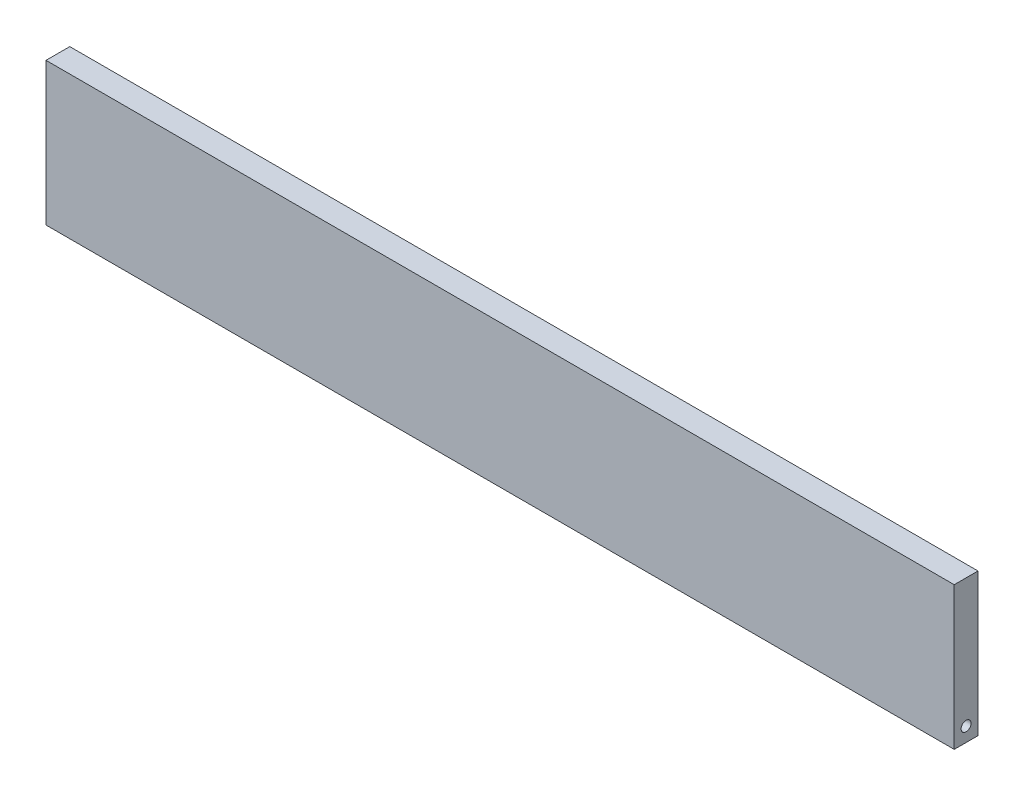
ISO-10303-21;
HEADER;
FILE_DESCRIPTION(('STEP AP214'),'2;1');
FILE_NAME('part.step','',(''),(''),'','','');
FILE_SCHEMA(('AUTOMOTIVE_DESIGN { 1 0 10303 214 1 1 1 1 }'));
ENDSEC;
DATA;
#1=APPLICATION_CONTEXT('core data for automotive mechanical design processes');
#2=APPLICATION_PROTOCOL_DEFINITION('international standard','automotive_design',2000,#1);
#3=PRODUCT_CONTEXT('',#1,'mechanical');
#4=PRODUCT('Part','Part','',(#3));
#5=PRODUCT_RELATED_PRODUCT_CATEGORY('part','',(#4));
#6=PRODUCT_DEFINITION_FORMATION('','',#4);
#7=PRODUCT_DEFINITION_CONTEXT('part definition',#1,'design');
#8=PRODUCT_DEFINITION('design','',#6,#7);
#9=PRODUCT_DEFINITION_SHAPE('','',#8);
#10=(LENGTH_UNIT() NAMED_UNIT(*) SI_UNIT(.MILLI.,.METRE.));
#11=(NAMED_UNIT(*) PLANE_ANGLE_UNIT() SI_UNIT($,.RADIAN.));
#12=(NAMED_UNIT(*) SI_UNIT($,.STERADIAN.) SOLID_ANGLE_UNIT());
#13=UNCERTAINTY_MEASURE_WITH_UNIT(LENGTH_MEASURE(1.E-05),#10,'distance_accuracy_value','');
#14=(GEOMETRIC_REPRESENTATION_CONTEXT(3) GLOBAL_UNCERTAINTY_ASSIGNED_CONTEXT((#13)) GLOBAL_UNIT_ASSIGNED_CONTEXT((#10,
#11,#12)) REPRESENTATION_CONTEXT('',''));
#15=CARTESIAN_POINT('',(0.,0.,0.));
#16=DIRECTION('',(0.,0.,1.));
#17=DIRECTION('',(1.,0.,0.));
#18=AXIS2_PLACEMENT_3D('',#15,#16,#17);
#19=CARTESIAN_POINT('',(-88.3428222094362,-16.3742424242424,5.));
#20=DIRECTION('',(1.,0.,0.));
#21=DIRECTION('',(0.,1.,0.));
#22=AXIS2_PLACEMENT_3D('',#19,#20,#21);
#23=PLANE('',#22);
#24=CARTESIAN_POINT('',(-88.3428222094362,-43.3742424242423,2.5));
#25=DIRECTION('',(1.,0.,0.));
#26=DIRECTION('',(0.,1.,0.));
#27=AXIS2_PLACEMENT_3D('',#24,#25,#26);
#28=CIRCLE('',#27,1.05);
#29=CARTESIAN_POINT('',(-88.3428222094362,-42.3242424242423,2.5));
#30=VERTEX_POINT('',#29);
#31=EDGE_CURVE('E112',#30,#30,#28,.T.);
#32=ORIENTED_EDGE('',*,*,#31,.T.);
#33=EDGE_LOOP('',(#32));
#34=FACE_BOUND('',#33,.T.);
#35=DIRECTION('',(0.,-1.,0.));
#36=VECTOR('',#35,1.);
#37=CARTESIAN_POINT('',(-88.3428222094362,-16.3742424242424,0.));
#38=LINE('',#37,#36);
#39=CARTESIAN_POINT('',(-88.3428222094362,-16.3742424242424,0.));
#40=VERTEX_POINT('',#39);
#41=CARTESIAN_POINT('',(-88.3428222094362,-46.3742424242424,0.));
#42=VERTEX_POINT('',#41);
#43=EDGE_CURVE('E95',#40,#42,#38,.T.);
#44=ORIENTED_EDGE('',*,*,#43,.T.);
#45=DIRECTION('',(0.,0.,-1.));
#46=VECTOR('',#45,1.);
#47=CARTESIAN_POINT('',(-88.3428222094362,-46.3742424242424,5.));
#48=LINE('',#47,#46);
#49=CARTESIAN_POINT('',(-88.3428222094362,-46.3742424242424,5.));
#50=VERTEX_POINT('',#49);
#51=EDGE_CURVE('E11',#50,#42,#48,.T.);
#52=ORIENTED_EDGE('',*,*,#51,.F.);
#53=DIRECTION('',(0.,-1.,0.));
#54=VECTOR('',#53,1.);
#55=CARTESIAN_POINT('',(-88.3428222094362,-16.3742424242424,5.));
#56=LINE('',#55,#54);
#57=CARTESIAN_POINT('',(-88.3428222094362,-16.3742424242424,5.));
#58=VERTEX_POINT('',#57);
#59=EDGE_CURVE('E83',#58,#50,#56,.T.);
#60=ORIENTED_EDGE('',*,*,#59,.F.);
#61=DIRECTION('',(0.,0.,-1.));
#62=VECTOR('',#61,1.);
#63=CARTESIAN_POINT('',(-88.3428222094362,-16.3742424242424,5.));
#64=LINE('',#63,#62);
#65=EDGE_CURVE('E91',#58,#40,#64,.T.);
#66=ORIENTED_EDGE('',*,*,#65,.T.);
#67=EDGE_LOOP('',(#44,#52,#60,#66));
#68=FACE_BOUND('',#67,.T.);
#69=ADVANCED_FACE('F32',(#34,#68),#23,.F.);
#70=CARTESIAN_POINT('',(-88.3428222094362,-46.3742424242424,5.));
#71=DIRECTION('',(0.,1.,0.));
#72=DIRECTION('',(0.,0.,1.));
#73=AXIS2_PLACEMENT_3D('',#70,#71,#72);
#74=PLANE('',#73);
#75=DIRECTION('',(1.,0.,0.));
#76=VECTOR('',#75,1.);
#77=CARTESIAN_POINT('',(-88.3428222094362,-46.3742424242424,0.));
#78=LINE('',#77,#76);
#79=CARTESIAN_POINT('',(102.657177790564,-46.3742424242424,0.));
#80=VERTEX_POINT('',#79);
#81=EDGE_CURVE('E87',#42,#80,#78,.T.);
#82=ORIENTED_EDGE('',*,*,#81,.T.);
#83=DIRECTION('',(0.,0.,-1.));
#84=VECTOR('',#83,1.);
#85=CARTESIAN_POINT('',(102.657177790564,-46.3742424242424,5.));
#86=LINE('',#85,#84);
#87=CARTESIAN_POINT('',(102.657177790564,-46.3742424242424,5.));
#88=VERTEX_POINT('',#87);
#89=EDGE_CURVE('E40',#88,#80,#86,.T.);
#90=ORIENTED_EDGE('',*,*,#89,.F.);
#91=DIRECTION('',(1.,0.,0.));
#92=VECTOR('',#91,1.);
#93=CARTESIAN_POINT('',(-88.3428222094362,-46.3742424242424,5.));
#94=LINE('',#93,#92);
#95=EDGE_CURVE('E78',#50,#88,#94,.T.);
#96=ORIENTED_EDGE('',*,*,#95,.F.);
#97=ORIENTED_EDGE('',*,*,#51,.T.);
#98=EDGE_LOOP('',(#82,#90,#96,#97));
#99=FACE_BOUND('',#98,.T.);
#100=ADVANCED_FACE('F86',(#99),#74,.F.);
#101=CARTESIAN_POINT('',(102.657177790564,-16.3742424242424,5.));
#102=DIRECTION('',(-1.,0.,0.));
#103=DIRECTION('',(0.,-1.,0.));
#104=AXIS2_PLACEMENT_3D('',#101,#102,#103);
#105=PLANE('',#104);
#106=CARTESIAN_POINT('',(102.657177790564,-43.3742424242423,2.5));
#107=DIRECTION('',(1.,0.,0.));
#108=DIRECTION('',(0.,1.,0.));
#109=AXIS2_PLACEMENT_3D('',#106,#107,#108);
#110=CIRCLE('',#109,1.05);
#111=CARTESIAN_POINT('',(102.657177790564,-42.3242424242423,2.5));
#112=VERTEX_POINT('',#111);
#113=EDGE_CURVE('E109',#112,#112,#110,.T.);
#114=ORIENTED_EDGE('',*,*,#113,.F.);
#115=EDGE_LOOP('',(#114));
#116=FACE_BOUND('',#115,.T.);
#117=DIRECTION('',(0.,1.,0.));
#118=VECTOR('',#117,1.);
#119=CARTESIAN_POINT('',(102.657177790564,-16.3742424242424,0.));
#120=LINE('',#119,#118);
#121=CARTESIAN_POINT('',(102.657177790564,-16.3742424242424,0.));
#122=VERTEX_POINT('',#121);
#123=EDGE_CURVE('E65',#80,#122,#120,.T.);
#124=ORIENTED_EDGE('',*,*,#123,.T.);
#125=DIRECTION('',(0.,0.,-1.));
#126=VECTOR('',#125,1.);
#127=CARTESIAN_POINT('',(102.657177790564,-16.3742424242424,5.));
#128=LINE('',#127,#126);
#129=CARTESIAN_POINT('',(102.657177790564,-16.3742424242424,5.));
#130=VERTEX_POINT('',#129);
#131=EDGE_CURVE('E88',#130,#122,#128,.T.);
#132=ORIENTED_EDGE('',*,*,#131,.F.);
#133=DIRECTION('',(0.,1.,0.));
#134=VECTOR('',#133,1.);
#135=CARTESIAN_POINT('',(102.657177790564,-16.3742424242424,5.));
#136=LINE('',#135,#134);
#137=EDGE_CURVE('E81',#88,#130,#136,.T.);
#138=ORIENTED_EDGE('',*,*,#137,.F.);
#139=ORIENTED_EDGE('',*,*,#89,.T.);
#140=EDGE_LOOP('',(#124,#132,#138,#139));
#141=FACE_BOUND('',#140,.T.);
#142=ADVANCED_FACE('F89',(#116,#141),#105,.F.);
#143=CARTESIAN_POINT('',(-88.3428222094362,-16.3742424242424,5.));
#144=DIRECTION('',(0.,-1.,0.));
#145=DIRECTION('',(0.,0.,-1.));
#146=AXIS2_PLACEMENT_3D('',#143,#144,#145);
#147=PLANE('',#146);
#148=DIRECTION('',(-1.,0.,0.));
#149=VECTOR('',#148,1.);
#150=CARTESIAN_POINT('',(-88.3428222094362,-16.3742424242424,0.));
#151=LINE('',#150,#149);
#152=EDGE_CURVE('E71',#122,#40,#151,.T.);
#153=ORIENTED_EDGE('',*,*,#152,.T.);
#154=ORIENTED_EDGE('',*,*,#65,.F.);
#155=DIRECTION('',(-1.,0.,0.));
#156=VECTOR('',#155,1.);
#157=CARTESIAN_POINT('',(-88.3428222094362,-16.3742424242424,5.));
#158=LINE('',#157,#156);
#159=EDGE_CURVE('E48',#130,#58,#158,.T.);
#160=ORIENTED_EDGE('',*,*,#159,.F.);
#161=ORIENTED_EDGE('',*,*,#131,.T.);
#162=EDGE_LOOP('',(#153,#154,#160,#161));
#163=FACE_BOUND('',#162,.T.);
#164=ADVANCED_FACE('F103',(#163),#147,.F.);
#165=CARTESIAN_POINT('',(0.,0.,5.));
#166=DIRECTION('',(0.,0.,1.));
#167=DIRECTION('',(1.,0.,0.));
#168=AXIS2_PLACEMENT_3D('',#165,#166,#167);
#169=PLANE('',#168);
#170=ORIENTED_EDGE('',*,*,#59,.T.);
#171=ORIENTED_EDGE('',*,*,#95,.T.);
#172=ORIENTED_EDGE('',*,*,#137,.T.);
#173=ORIENTED_EDGE('',*,*,#159,.T.);
#174=EDGE_LOOP('',(#170,#171,#172,#173));
#175=FACE_BOUND('',#174,.T.);
#176=ADVANCED_FACE('F79',(#175),#169,.T.);
#177=CARTESIAN_POINT('',(0.,0.,0.));
#178=DIRECTION('',(0.,0.,1.));
#179=DIRECTION('',(1.,0.,0.));
#180=AXIS2_PLACEMENT_3D('',#177,#178,#179);
#181=PLANE('',#180);
#182=ORIENTED_EDGE('',*,*,#43,.F.);
#183=ORIENTED_EDGE('',*,*,#152,.F.);
#184=ORIENTED_EDGE('',*,*,#123,.F.);
#185=ORIENTED_EDGE('',*,*,#81,.F.);
#186=EDGE_LOOP('',(#182,#183,#184,#185));
#187=FACE_BOUND('',#186,.T.);
#188=ADVANCED_FACE('F106',(#187),#181,.F.);
#189=CARTESIAN_POINT('',(92.6571777905638,-43.3742424242423,2.5));
#190=DIRECTION('',(1.,0.,0.));
#191=DIRECTION('',(0.,1.,0.));
#192=AXIS2_PLACEMENT_3D('',#189,#190,#191);
#193=CYLINDRICAL_SURFACE('',#192,1.05);
#194=CARTESIAN_POINT('',(92.6571777905638,-43.3742424242423,2.5));
#195=DIRECTION('',(1.,0.,0.));
#196=DIRECTION('',(0.,1.,0.));
#197=AXIS2_PLACEMENT_3D('',#194,#195,#196);
#198=CIRCLE('',#197,1.05);
#199=CARTESIAN_POINT('',(92.6571777905638,-42.3242424242423,2.5));
#200=VERTEX_POINT('',#199);
#201=EDGE_CURVE('E98',#200,#200,#198,.T.);
#202=ORIENTED_EDGE('',*,*,#201,.F.);
#203=EDGE_LOOP('',(#202));
#204=FACE_BOUND('',#203,.T.);
#205=ORIENTED_EDGE('',*,*,#113,.T.);
#206=EDGE_LOOP('',(#205));
#207=FACE_BOUND('',#206,.T.);
#208=ADVANCED_FACE('F148',(#204,#207),#193,.F.);
#209=CARTESIAN_POINT('',(92.6571777905638,-43.3742424242423,2.5));
#210=DIRECTION('',(1.,0.,0.));
#211=DIRECTION('',(0.,1.,0.));
#212=AXIS2_PLACEMENT_3D('',#209,#210,#211);
#213=PLANE('',#212);
#214=ORIENTED_EDGE('',*,*,#201,.T.);
#215=EDGE_LOOP('',(#214));
#216=FACE_BOUND('',#215,.T.);
#217=ADVANCED_FACE('F126',(#216),#213,.T.);
#218=CARTESIAN_POINT('',(-88.3428222094362,-43.3742424242423,2.5));
#219=DIRECTION('',(1.,0.,0.));
#220=DIRECTION('',(0.,1.,0.));
#221=AXIS2_PLACEMENT_3D('',#218,#219,#220);
#222=CYLINDRICAL_SURFACE('',#221,1.05);
#223=ORIENTED_EDGE('',*,*,#31,.F.);
#224=EDGE_LOOP('',(#223));
#225=FACE_BOUND('',#224,.T.);
#226=CARTESIAN_POINT('',(-78.3428222094362,-43.3742424242423,2.5));
#227=DIRECTION('',(1.,0.,0.));
#228=DIRECTION('',(0.,1.,0.));
#229=AXIS2_PLACEMENT_3D('',#226,#227,#228);
#230=CIRCLE('',#229,1.05);
#231=CARTESIAN_POINT('',(-78.3428222094362,-42.3242424242423,2.5));
#232=VERTEX_POINT('',#231);
#233=EDGE_CURVE('E115',#232,#232,#230,.T.);
#234=ORIENTED_EDGE('',*,*,#233,.T.);
#235=EDGE_LOOP('',(#234));
#236=FACE_BOUND('',#235,.T.);
#237=ADVANCED_FACE('F122',(#225,#236),#222,.F.);
#238=CARTESIAN_POINT('',(-78.3428222094362,-43.3742424242423,2.5));
#239=DIRECTION('',(1.,0.,0.));
#240=DIRECTION('',(0.,1.,0.));
#241=AXIS2_PLACEMENT_3D('',#238,#239,#240);
#242=PLANE('',#241);
#243=ORIENTED_EDGE('',*,*,#233,.F.);
#244=EDGE_LOOP('',(#243));
#245=FACE_BOUND('',#244,.T.);
#246=ADVANCED_FACE('F125',(#245),#242,.F.);
#247=CLOSED_SHELL('',(#69,#100,#142,#164,#176,#188,#208,#217,#237,#246));
#248=MANIFOLD_SOLID_BREP('B2',#247);
#249=ADVANCED_BREP_SHAPE_REPRESENTATION('',(#18,#248),#14);
#250=SHAPE_DEFINITION_REPRESENTATION(#9,#249);
ENDSEC;
END-ISO-10303-21;
